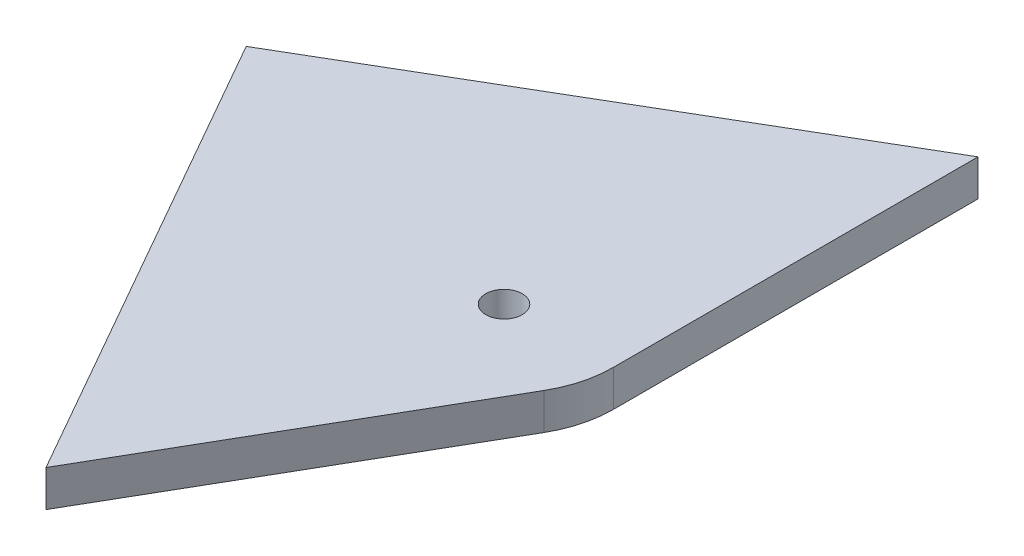
ISO-10303-21;
HEADER;
FILE_DESCRIPTION(('STEP AP214'),'2;1');
FILE_NAME('part.step','',(''),(''),'','','');
FILE_SCHEMA(('AUTOMOTIVE_DESIGN { 1 0 10303 214 1 1 1 1 }'));
ENDSEC;
DATA;
#1=APPLICATION_CONTEXT('core data for automotive mechanical design processes');
#2=APPLICATION_PROTOCOL_DEFINITION('international standard','automotive_design',2000,#1);
#3=PRODUCT_CONTEXT('',#1,'mechanical');
#4=PRODUCT('Part','Part','',(#3));
#5=PRODUCT_RELATED_PRODUCT_CATEGORY('part','',(#4));
#6=PRODUCT_DEFINITION_FORMATION('','',#4);
#7=PRODUCT_DEFINITION_CONTEXT('part definition',#1,'design');
#8=PRODUCT_DEFINITION('design','',#6,#7);
#9=PRODUCT_DEFINITION_SHAPE('','',#8);
#10=(LENGTH_UNIT() NAMED_UNIT(*) SI_UNIT(.MILLI.,.METRE.));
#11=(NAMED_UNIT(*) PLANE_ANGLE_UNIT() SI_UNIT($,.RADIAN.));
#12=(NAMED_UNIT(*) SI_UNIT($,.STERADIAN.) SOLID_ANGLE_UNIT());
#13=UNCERTAINTY_MEASURE_WITH_UNIT(LENGTH_MEASURE(1.E-05),#10,'distance_accuracy_value','');
#14=(GEOMETRIC_REPRESENTATION_CONTEXT(3) GLOBAL_UNCERTAINTY_ASSIGNED_CONTEXT((#13)) GLOBAL_UNIT_ASSIGNED_CONTEXT((#10,
#11,#12)) REPRESENTATION_CONTEXT('',''));
#15=CARTESIAN_POINT('',(0.,0.,0.));
#16=DIRECTION('',(0.,0.,1.));
#17=DIRECTION('',(1.,0.,0.));
#18=AXIS2_PLACEMENT_3D('',#15,#16,#17);
#19=CARTESIAN_POINT('',(0.,2.,0.));
#20=DIRECTION('',(0.,-1.,0.));
#21=DIRECTION('',(0.,0.,-1.));
#22=AXIS2_PLACEMENT_3D('',#19,#20,#21);
#23=PLANE('',#22);
#24=CARTESIAN_POINT('',(0.,2.,0.));
#25=DIRECTION('',(0.,1.,0.));
#26=DIRECTION('',(0.,0.,-1.));
#27=AXIS2_PLACEMENT_3D('',#24,#25,#26);
#28=CIRCLE('',#27,6.);
#29=CARTESIAN_POINT('',(5.19615242270663,2.,3.00000000000001));
#30=VERTEX_POINT('',#29);
#31=CARTESIAN_POINT('',(6.,2.,0.));
#32=VERTEX_POINT('',#31);
#33=EDGE_CURVE('E121',#30,#32,#28,.T.);
#34=ORIENTED_EDGE('',*,*,#33,.T.);
#35=DIRECTION('',(0.,0.,-1.));
#36=VECTOR('',#35,1.);
#37=CARTESIAN_POINT('',(6.,2.,0.));
#38=LINE('',#37,#36);
#39=CARTESIAN_POINT('',(6.,2.,-20.));
#40=VERTEX_POINT('',#39);
#41=EDGE_CURVE('E88',#32,#40,#38,.T.);
#42=ORIENTED_EDGE('',*,*,#41,.T.);
#43=DIRECTION('',(-0.862969528223436,0.,0.505255968156557));
#44=VECTOR('',#43,1.);
#45=CARTESIAN_POINT('',(-19.3185165257814,2.,-5.17638090205042));
#46=LINE('',#45,#44);
#47=CARTESIAN_POINT('',(-19.3185165257814,2.,-5.17638090205042));
#48=VERTEX_POINT('',#47);
#49=EDGE_CURVE('E92',#40,#48,#46,.T.);
#50=ORIENTED_EDGE('',*,*,#49,.T.);
#51=DIRECTION('',(0.494725550055088,0.,0.869049267948999));
#52=VECTOR('',#51,1.);
#53=CARTESIAN_POINT('',(-4.80384757729339,2.,20.3205080756888));
#54=LINE('',#53,#52);
#55=CARTESIAN_POINT('',(-4.80384757729339,2.,20.3205080756888));
#56=VERTEX_POINT('',#55);
#57=EDGE_CURVE('E96',#48,#56,#54,.T.);
#58=ORIENTED_EDGE('',*,*,#57,.T.);
#59=DIRECTION('',(0.500000000000001,0.,-0.866025403784438));
#60=VECTOR('',#59,1.);
#61=CARTESIAN_POINT('',(5.19615242270663,2.,3.00000000000001));
#62=LINE('',#61,#60);
#63=EDGE_CURVE('E54',#56,#30,#62,.T.);
#64=ORIENTED_EDGE('',*,*,#63,.T.);
#65=EDGE_LOOP('',(#34,#42,#50,#58,#64));
#66=FACE_BOUND('',#65,.T.);
#67=CARTESIAN_POINT('',(0.,2.,0.));
#68=DIRECTION('',(0.,1.,0.));
#69=DIRECTION('',(0.,0.,1.));
#70=AXIS2_PLACEMENT_3D('',#67,#68,#69);
#71=CIRCLE('',#70,1.);
#72=CARTESIAN_POINT('',(0.,2.,1.));
#73=VERTEX_POINT('',#72);
#74=EDGE_CURVE('E116',#73,#73,#71,.T.);
#75=ORIENTED_EDGE('',*,*,#74,.F.);
#76=EDGE_LOOP('',(#75));
#77=FACE_BOUND('',#76,.T.);
#78=ADVANCED_FACE('F37',(#66,#77),#23,.F.);
#79=CARTESIAN_POINT('',(0.,0.,0.));
#80=DIRECTION('',(0.,-1.,0.));
#81=DIRECTION('',(0.,0.,-1.));
#82=AXIS2_PLACEMENT_3D('',#79,#80,#81);
#83=PLANE('',#82);
#84=CARTESIAN_POINT('',(0.,0.,0.));
#85=DIRECTION('',(0.,1.,0.));
#86=DIRECTION('',(0.,0.,-1.));
#87=AXIS2_PLACEMENT_3D('',#84,#85,#86);
#88=CIRCLE('',#87,6.);
#89=CARTESIAN_POINT('',(5.19615242270663,0.,3.00000000000001));
#90=VERTEX_POINT('',#89);
#91=CARTESIAN_POINT('',(6.,0.,0.));
#92=VERTEX_POINT('',#91);
#93=EDGE_CURVE('E112',#90,#92,#88,.T.);
#94=ORIENTED_EDGE('',*,*,#93,.F.);
#95=DIRECTION('',(0.500000000000001,0.,-0.866025403784438));
#96=VECTOR('',#95,1.);
#97=CARTESIAN_POINT('',(5.19615242270663,0.,3.00000000000001));
#98=LINE('',#97,#96);
#99=CARTESIAN_POINT('',(-4.80384757729339,0.,20.3205080756888));
#100=VERTEX_POINT('',#99);
#101=EDGE_CURVE('E80',#100,#90,#98,.T.);
#102=ORIENTED_EDGE('',*,*,#101,.F.);
#103=DIRECTION('',(0.494725550055088,0.,0.869049267948999));
#104=VECTOR('',#103,1.);
#105=CARTESIAN_POINT('',(-4.80384757729339,0.,20.3205080756888));
#106=LINE('',#105,#104);
#107=CARTESIAN_POINT('',(-19.3185165257814,0.,-5.17638090205042));
#108=VERTEX_POINT('',#107);
#109=EDGE_CURVE('E74',#108,#100,#106,.T.);
#110=ORIENTED_EDGE('',*,*,#109,.F.);
#111=DIRECTION('',(-0.862969528223436,0.,0.505255968156557));
#112=VECTOR('',#111,1.);
#113=CARTESIAN_POINT('',(-19.3185165257814,0.,-5.17638090205042));
#114=LINE('',#113,#112);
#115=CARTESIAN_POINT('',(6.,0.,-20.));
#116=VERTEX_POINT('',#115);
#117=EDGE_CURVE('E103',#116,#108,#114,.T.);
#118=ORIENTED_EDGE('',*,*,#117,.F.);
#119=DIRECTION('',(0.,0.,-1.));
#120=VECTOR('',#119,1.);
#121=CARTESIAN_POINT('',(6.,0.,0.));
#122=LINE('',#121,#120);
#123=EDGE_CURVE('E115',#92,#116,#122,.T.);
#124=ORIENTED_EDGE('',*,*,#123,.F.);
#125=EDGE_LOOP('',(#94,#102,#110,#118,#124));
#126=FACE_BOUND('',#125,.T.);
#127=CARTESIAN_POINT('',(0.,0.,0.));
#128=DIRECTION('',(0.,1.,0.));
#129=DIRECTION('',(0.,0.,1.));
#130=AXIS2_PLACEMENT_3D('',#127,#128,#129);
#131=CIRCLE('',#130,1.);
#132=CARTESIAN_POINT('',(0.,0.,1.));
#133=VERTEX_POINT('',#132);
#134=EDGE_CURVE('E217',#133,#133,#131,.T.);
#135=ORIENTED_EDGE('',*,*,#134,.T.);
#136=EDGE_LOOP('',(#135));
#137=FACE_BOUND('',#136,.T.);
#138=ADVANCED_FACE('F125',(#126,#137),#83,.T.);
#139=CARTESIAN_POINT('',(0.,2.,0.));
#140=DIRECTION('',(0.,-1.,0.));
#141=DIRECTION('',(0.,0.,-1.));
#142=AXIS2_PLACEMENT_3D('',#139,#140,#141);
#143=CYLINDRICAL_SURFACE('',#142,6.);
#144=ORIENTED_EDGE('',*,*,#93,.T.);
#145=DIRECTION('',(0.,-1.,0.));
#146=VECTOR('',#145,1.);
#147=CARTESIAN_POINT('',(6.,2.,0.));
#148=LINE('',#147,#146);
#149=EDGE_CURVE('E11',#32,#92,#148,.T.);
#150=ORIENTED_EDGE('',*,*,#149,.F.);
#151=ORIENTED_EDGE('',*,*,#33,.F.);
#152=DIRECTION('',(0.,-1.,0.));
#153=VECTOR('',#152,1.);
#154=CARTESIAN_POINT('',(5.19615242270663,2.,3.00000000000001));
#155=LINE('',#154,#153);
#156=EDGE_CURVE('E108',#30,#90,#155,.T.);
#157=ORIENTED_EDGE('',*,*,#156,.T.);
#158=EDGE_LOOP('',(#144,#150,#151,#157));
#159=FACE_BOUND('',#158,.T.);
#160=ADVANCED_FACE('F39',(#159),#143,.T.);
#161=CARTESIAN_POINT('',(6.,2.,0.));
#162=DIRECTION('',(-1.,0.,0.));
#163=DIRECTION('',(0.,0.,1.));
#164=AXIS2_PLACEMENT_3D('',#161,#162,#163);
#165=PLANE('',#164);
#166=ORIENTED_EDGE('',*,*,#123,.T.);
#167=DIRECTION('',(0.,-1.,0.));
#168=VECTOR('',#167,1.);
#169=CARTESIAN_POINT('',(6.,2.,-20.));
#170=LINE('',#169,#168);
#171=EDGE_CURVE('E46',#40,#116,#170,.T.);
#172=ORIENTED_EDGE('',*,*,#171,.F.);
#173=ORIENTED_EDGE('',*,*,#41,.F.);
#174=ORIENTED_EDGE('',*,*,#149,.T.);
#175=EDGE_LOOP('',(#166,#172,#173,#174));
#176=FACE_BOUND('',#175,.T.);
#177=ADVANCED_FACE('F150',(#176),#165,.F.);
#178=CARTESIAN_POINT('',(-19.3185165257814,2.,-5.17638090205042));
#179=DIRECTION('',(0.505255968156557,0.,0.862969528223436));
#180=DIRECTION('',(0.862969528223436,0.,-0.505255968156557));
#181=AXIS2_PLACEMENT_3D('',#178,#179,#180);
#182=PLANE('',#181);
#183=ORIENTED_EDGE('',*,*,#117,.T.);
#184=DIRECTION('',(0.,-1.,0.));
#185=VECTOR('',#184,1.);
#186=CARTESIAN_POINT('',(-19.3185165257814,2.,-5.17638090205042));
#187=LINE('',#186,#185);
#188=EDGE_CURVE('E100',#48,#108,#187,.T.);
#189=ORIENTED_EDGE('',*,*,#188,.F.);
#190=ORIENTED_EDGE('',*,*,#49,.F.);
#191=ORIENTED_EDGE('',*,*,#171,.T.);
#192=EDGE_LOOP('',(#183,#189,#190,#191));
#193=FACE_BOUND('',#192,.T.);
#194=ADVANCED_FACE('F101',(#193),#182,.F.);
#195=CARTESIAN_POINT('',(-4.80384757729339,2.,20.3205080756888));
#196=DIRECTION('',(0.869049267948999,0.,-0.494725550055088));
#197=DIRECTION('',(-0.494725550055088,0.,-0.869049267948999));
#198=AXIS2_PLACEMENT_3D('',#195,#196,#197);
#199=PLANE('',#198);
#200=ORIENTED_EDGE('',*,*,#109,.T.);
#201=DIRECTION('',(0.,-1.,0.));
#202=VECTOR('',#201,1.);
#203=CARTESIAN_POINT('',(-4.80384757729339,2.,20.3205080756888));
#204=LINE('',#203,#202);
#205=EDGE_CURVE('E104',#56,#100,#204,.T.);
#206=ORIENTED_EDGE('',*,*,#205,.F.);
#207=ORIENTED_EDGE('',*,*,#57,.F.);
#208=ORIENTED_EDGE('',*,*,#188,.T.);
#209=EDGE_LOOP('',(#200,#206,#207,#208));
#210=FACE_BOUND('',#209,.T.);
#211=ADVANCED_FACE('F106',(#210),#199,.F.);
#212=CARTESIAN_POINT('',(5.19615242270663,2.,3.00000000000001));
#213=DIRECTION('',(-0.866025403784438,0.,-0.500000000000001));
#214=DIRECTION('',(-0.500000000000001,0.,0.866025403784438));
#215=AXIS2_PLACEMENT_3D('',#212,#213,#214);
#216=PLANE('',#215);
#217=ORIENTED_EDGE('',*,*,#101,.T.);
#218=ORIENTED_EDGE('',*,*,#156,.F.);
#219=ORIENTED_EDGE('',*,*,#63,.F.);
#220=ORIENTED_EDGE('',*,*,#205,.T.);
#221=EDGE_LOOP('',(#217,#218,#219,#220));
#222=FACE_BOUND('',#221,.T.);
#223=ADVANCED_FACE('F130',(#222),#216,.F.);
#224=CARTESIAN_POINT('',(0.,2.,0.));
#225=DIRECTION('',(0.,-1.,0.));
#226=DIRECTION('',(0.,0.,-1.));
#227=AXIS2_PLACEMENT_3D('',#224,#225,#226);
#228=CYLINDRICAL_SURFACE('',#227,1.);
#229=ORIENTED_EDGE('',*,*,#74,.T.);
#230=EDGE_LOOP('',(#229));
#231=FACE_BOUND('',#230,.T.);
#232=ORIENTED_EDGE('',*,*,#134,.F.);
#233=EDGE_LOOP('',(#232));
#234=FACE_BOUND('',#233,.T.);
#235=ADVANCED_FACE('F132',(#231,#234),#228,.F.);
#236=CLOSED_SHELL('',(#78,#138,#160,#177,#194,#211,#223,#235));
#237=MANIFOLD_SOLID_BREP('B2',#236);
#238=ADVANCED_BREP_SHAPE_REPRESENTATION('',(#18,#237),#14);
#239=SHAPE_DEFINITION_REPRESENTATION(#9,#238);
ENDSEC;
END-ISO-10303-21;
